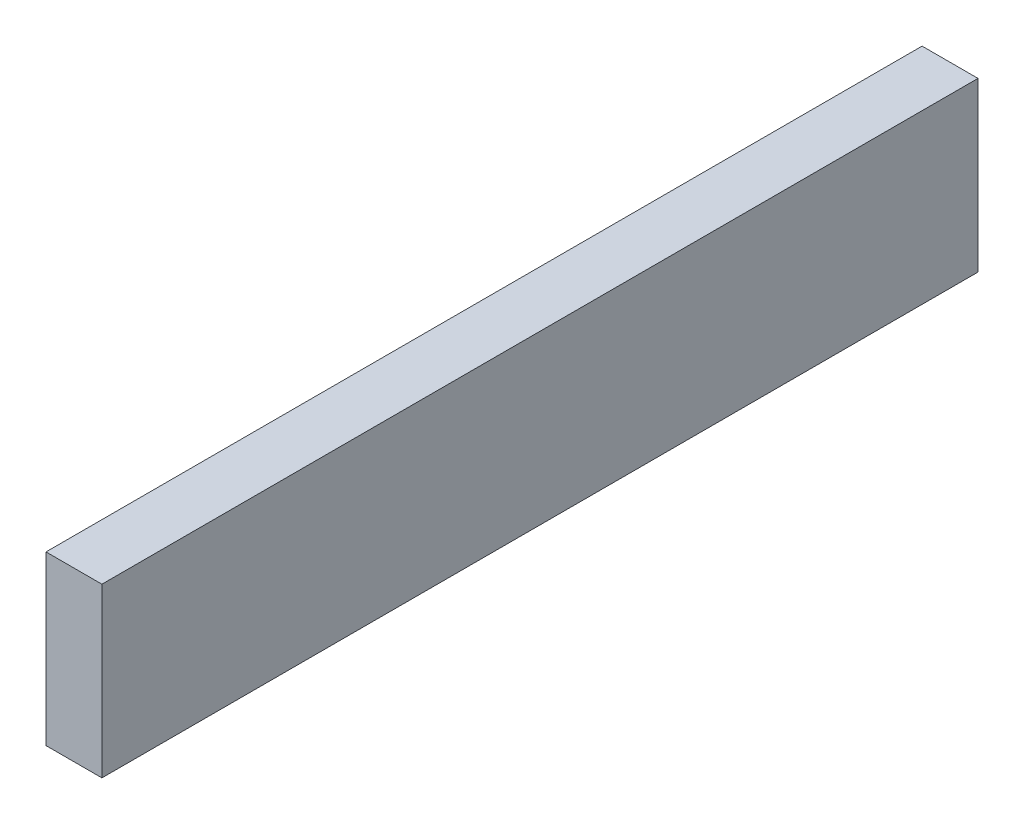
ISO-10303-21;
HEADER;
FILE_DESCRIPTION(('STEP AP214'),'2;1');
FILE_NAME('part.step','',(''),(''),'','','');
FILE_SCHEMA(('AUTOMOTIVE_DESIGN { 1 0 10303 214 1 1 1 1 }'));
ENDSEC;
DATA;
#1=APPLICATION_CONTEXT('core data for automotive mechanical design processes');
#2=APPLICATION_PROTOCOL_DEFINITION('international standard','automotive_design',2000,#1);
#3=PRODUCT_CONTEXT('',#1,'mechanical');
#4=PRODUCT('Part','Part','',(#3));
#5=PRODUCT_RELATED_PRODUCT_CATEGORY('part','',(#4));
#6=PRODUCT_DEFINITION_FORMATION('','',#4);
#7=PRODUCT_DEFINITION_CONTEXT('part definition',#1,'design');
#8=PRODUCT_DEFINITION('design','',#6,#7);
#9=PRODUCT_DEFINITION_SHAPE('','',#8);
#10=(LENGTH_UNIT() NAMED_UNIT(*) SI_UNIT(.MILLI.,.METRE.));
#11=(NAMED_UNIT(*) PLANE_ANGLE_UNIT() SI_UNIT($,.RADIAN.));
#12=(NAMED_UNIT(*) SI_UNIT($,.STERADIAN.) SOLID_ANGLE_UNIT());
#13=UNCERTAINTY_MEASURE_WITH_UNIT(LENGTH_MEASURE(1.E-05),#10,'distance_accuracy_value','');
#14=(GEOMETRIC_REPRESENTATION_CONTEXT(3) GLOBAL_UNCERTAINTY_ASSIGNED_CONTEXT((#13)) GLOBAL_UNIT_ASSIGNED_CONTEXT((#10,
#11,#12)) REPRESENTATION_CONTEXT('',''));
#15=CARTESIAN_POINT('',(0.,0.,0.));
#16=DIRECTION('',(0.,0.,1.));
#17=DIRECTION('',(1.,0.,0.));
#18=AXIS2_PLACEMENT_3D('',#15,#16,#17);
#19=CARTESIAN_POINT('',(15.,-45.,235.));
#20=DIRECTION('',(-1.,0.,0.));
#21=DIRECTION('',(0.,0.,1.));
#22=AXIS2_PLACEMENT_3D('',#19,#20,#21);
#23=PLANE('',#22);
#24=DIRECTION('',(0.,1.,0.));
#25=VECTOR('',#24,1.);
#26=CARTESIAN_POINT('',(15.,-45.,-235.));
#27=LINE('',#26,#25);
#28=CARTESIAN_POINT('',(15.,-45.,-235.));
#29=VERTEX_POINT('',#28);
#30=CARTESIAN_POINT('',(15.,45.,-235.));
#31=VERTEX_POINT('',#30);
#32=EDGE_CURVE('E95',#29,#31,#27,.T.);
#33=ORIENTED_EDGE('',*,*,#32,.T.);
#34=DIRECTION('',(0.,0.,-1.));
#35=VECTOR('',#34,1.);
#36=CARTESIAN_POINT('',(15.,45.,235.));
#37=LINE('',#36,#35);
#38=CARTESIAN_POINT('',(15.,45.,235.));
#39=VERTEX_POINT('',#38);
#40=EDGE_CURVE('E11',#39,#31,#37,.T.);
#41=ORIENTED_EDGE('',*,*,#40,.F.);
#42=DIRECTION('',(0.,1.,0.));
#43=VECTOR('',#42,1.);
#44=CARTESIAN_POINT('',(15.,-45.,235.));
#45=LINE('',#44,#43);
#46=CARTESIAN_POINT('',(15.,-45.,235.));
#47=VERTEX_POINT('',#46);
#48=EDGE_CURVE('E83',#47,#39,#45,.T.);
#49=ORIENTED_EDGE('',*,*,#48,.F.);
#50=DIRECTION('',(0.,0.,-1.));
#51=VECTOR('',#50,1.);
#52=CARTESIAN_POINT('',(15.,-45.,235.));
#53=LINE('',#52,#51);
#54=EDGE_CURVE('E91',#47,#29,#53,.T.);
#55=ORIENTED_EDGE('',*,*,#54,.T.);
#56=EDGE_LOOP('',(#33,#41,#49,#55));
#57=FACE_BOUND('',#56,.T.);
#58=ADVANCED_FACE('F32',(#57),#23,.F.);
#59=CARTESIAN_POINT('',(-15.,45.,235.));
#60=DIRECTION('',(0.,-1.,0.));
#61=DIRECTION('',(0.,0.,-1.));
#62=AXIS2_PLACEMENT_3D('',#59,#60,#61);
#63=PLANE('',#62);
#64=DIRECTION('',(-1.,0.,0.));
#65=VECTOR('',#64,1.);
#66=CARTESIAN_POINT('',(-15.,45.,-235.));
#67=LINE('',#66,#65);
#68=CARTESIAN_POINT('',(-15.,45.,-235.));
#69=VERTEX_POINT('',#68);
#70=EDGE_CURVE('E87',#31,#69,#67,.T.);
#71=ORIENTED_EDGE('',*,*,#70,.T.);
#72=DIRECTION('',(0.,0.,-1.));
#73=VECTOR('',#72,1.);
#74=CARTESIAN_POINT('',(-15.,45.,235.));
#75=LINE('',#74,#73);
#76=CARTESIAN_POINT('',(-15.,45.,235.));
#77=VERTEX_POINT('',#76);
#78=EDGE_CURVE('E40',#77,#69,#75,.T.);
#79=ORIENTED_EDGE('',*,*,#78,.F.);
#80=DIRECTION('',(-1.,0.,0.));
#81=VECTOR('',#80,1.);
#82=CARTESIAN_POINT('',(-15.,45.,235.));
#83=LINE('',#82,#81);
#84=EDGE_CURVE('E78',#39,#77,#83,.T.);
#85=ORIENTED_EDGE('',*,*,#84,.F.);
#86=ORIENTED_EDGE('',*,*,#40,.T.);
#87=EDGE_LOOP('',(#71,#79,#85,#86));
#88=FACE_BOUND('',#87,.T.);
#89=ADVANCED_FACE('F86',(#88),#63,.F.);
#90=CARTESIAN_POINT('',(-15.,-45.,235.));
#91=DIRECTION('',(1.,0.,0.));
#92=DIRECTION('',(0.,0.,-1.));
#93=AXIS2_PLACEMENT_3D('',#90,#91,#92);
#94=PLANE('',#93);
#95=DIRECTION('',(0.,-1.,0.));
#96=VECTOR('',#95,1.);
#97=CARTESIAN_POINT('',(-15.,-45.,-235.));
#98=LINE('',#97,#96);
#99=CARTESIAN_POINT('',(-15.,-45.,-235.));
#100=VERTEX_POINT('',#99);
#101=EDGE_CURVE('E65',#69,#100,#98,.T.);
#102=ORIENTED_EDGE('',*,*,#101,.T.);
#103=DIRECTION('',(0.,0.,-1.));
#104=VECTOR('',#103,1.);
#105=CARTESIAN_POINT('',(-15.,-45.,235.));
#106=LINE('',#105,#104);
#107=CARTESIAN_POINT('',(-15.,-45.,235.));
#108=VERTEX_POINT('',#107);
#109=EDGE_CURVE('E88',#108,#100,#106,.T.);
#110=ORIENTED_EDGE('',*,*,#109,.F.);
#111=DIRECTION('',(0.,-1.,0.));
#112=VECTOR('',#111,1.);
#113=CARTESIAN_POINT('',(-15.,-45.,235.));
#114=LINE('',#113,#112);
#115=EDGE_CURVE('E81',#77,#108,#114,.T.);
#116=ORIENTED_EDGE('',*,*,#115,.F.);
#117=ORIENTED_EDGE('',*,*,#78,.T.);
#118=EDGE_LOOP('',(#102,#110,#116,#117));
#119=FACE_BOUND('',#118,.T.);
#120=ADVANCED_FACE('F89',(#119),#94,.F.);
#121=CARTESIAN_POINT('',(-15.,-45.,235.));
#122=DIRECTION('',(0.,1.,0.));
#123=DIRECTION('',(0.,0.,1.));
#124=AXIS2_PLACEMENT_3D('',#121,#122,#123);
#125=PLANE('',#124);
#126=DIRECTION('',(1.,0.,0.));
#127=VECTOR('',#126,1.);
#128=CARTESIAN_POINT('',(-15.,-45.,-235.));
#129=LINE('',#128,#127);
#130=EDGE_CURVE('E71',#100,#29,#129,.T.);
#131=ORIENTED_EDGE('',*,*,#130,.T.);
#132=ORIENTED_EDGE('',*,*,#54,.F.);
#133=DIRECTION('',(1.,0.,0.));
#134=VECTOR('',#133,1.);
#135=CARTESIAN_POINT('',(-15.,-45.,235.));
#136=LINE('',#135,#134);
#137=EDGE_CURVE('E48',#108,#47,#136,.T.);
#138=ORIENTED_EDGE('',*,*,#137,.F.);
#139=ORIENTED_EDGE('',*,*,#109,.T.);
#140=EDGE_LOOP('',(#131,#132,#138,#139));
#141=FACE_BOUND('',#140,.T.);
#142=ADVANCED_FACE('F102',(#141),#125,.F.);
#143=CARTESIAN_POINT('',(0.,0.,235.));
#144=DIRECTION('',(0.,0.,-1.));
#145=DIRECTION('',(-1.,0.,0.));
#146=AXIS2_PLACEMENT_3D('',#143,#144,#145);
#147=PLANE('',#146);
#148=ORIENTED_EDGE('',*,*,#48,.T.);
#149=ORIENTED_EDGE('',*,*,#84,.T.);
#150=ORIENTED_EDGE('',*,*,#115,.T.);
#151=ORIENTED_EDGE('',*,*,#137,.T.);
#152=EDGE_LOOP('',(#148,#149,#150,#151));
#153=FACE_BOUND('',#152,.T.);
#154=ADVANCED_FACE('F79',(#153),#147,.F.);
#155=CARTESIAN_POINT('',(0.,0.,-235.));
#156=DIRECTION('',(0.,0.,-1.));
#157=DIRECTION('',(-1.,0.,0.));
#158=AXIS2_PLACEMENT_3D('',#155,#156,#157);
#159=PLANE('',#158);
#160=ORIENTED_EDGE('',*,*,#32,.F.);
#161=ORIENTED_EDGE('',*,*,#130,.F.);
#162=ORIENTED_EDGE('',*,*,#101,.F.);
#163=ORIENTED_EDGE('',*,*,#70,.F.);
#164=EDGE_LOOP('',(#160,#161,#162,#163));
#165=FACE_BOUND('',#164,.T.);
#166=ADVANCED_FACE('F105',(#165),#159,.T.);
#167=CLOSED_SHELL('',(#58,#89,#120,#142,#154,#166));
#168=MANIFOLD_SOLID_BREP('B2',#167);
#169=ADVANCED_BREP_SHAPE_REPRESENTATION('',(#18,#168),#14);
#170=SHAPE_DEFINITION_REPRESENTATION(#9,#169);
ENDSEC;
END-ISO-10303-21;
